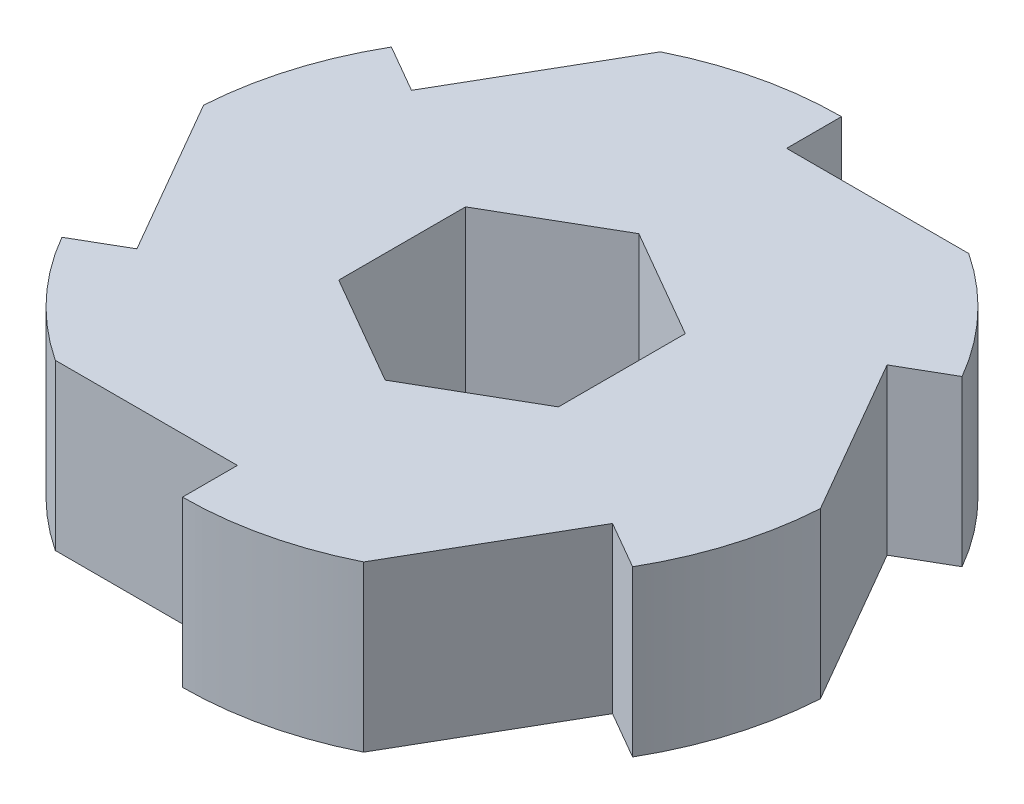
ISO-10303-21;
HEADER;
FILE_DESCRIPTION(('STEP AP214'),'2;1');
FILE_NAME('part.step','',(''),(''),'','','');
FILE_SCHEMA(('AUTOMOTIVE_DESIGN { 1 0 10303 214 1 1 1 1 }'));
ENDSEC;
DATA;
#1=APPLICATION_CONTEXT('core data for automotive mechanical design processes');
#2=APPLICATION_PROTOCOL_DEFINITION('international standard','automotive_design',2000,#1);
#3=PRODUCT_CONTEXT('',#1,'mechanical');
#4=PRODUCT('Part','Part','',(#3));
#5=PRODUCT_RELATED_PRODUCT_CATEGORY('part','',(#4));
#6=PRODUCT_DEFINITION_FORMATION('','',#4);
#7=PRODUCT_DEFINITION_CONTEXT('part definition',#1,'design');
#8=PRODUCT_DEFINITION('design','',#6,#7);
#9=PRODUCT_DEFINITION_SHAPE('','',#8);
#10=(LENGTH_UNIT() NAMED_UNIT(*) SI_UNIT(.MILLI.,.METRE.));
#11=(NAMED_UNIT(*) PLANE_ANGLE_UNIT() SI_UNIT($,.RADIAN.));
#12=(NAMED_UNIT(*) SI_UNIT($,.STERADIAN.) SOLID_ANGLE_UNIT());
#13=UNCERTAINTY_MEASURE_WITH_UNIT(LENGTH_MEASURE(1.E-05),#10,'distance_accuracy_value','');
#14=(GEOMETRIC_REPRESENTATION_CONTEXT(3) GLOBAL_UNCERTAINTY_ASSIGNED_CONTEXT((#13)) GLOBAL_UNIT_ASSIGNED_CONTEXT((#10,
#11,#12)) REPRESENTATION_CONTEXT('',''));
#15=CARTESIAN_POINT('',(0.,0.,0.));
#16=DIRECTION('',(0.,0.,1.));
#17=DIRECTION('',(1.,0.,0.));
#18=AXIS2_PLACEMENT_3D('',#15,#16,#17);
#19=CARTESIAN_POINT('',(0.,9.525,0.));
#20=DIRECTION('',(0.,-1.,0.));
#21=DIRECTION('',(0.,0.,-1.));
#22=AXIS2_PLACEMENT_3D('',#19,#20,#21);
#23=CYLINDRICAL_SURFACE('',#22,19.05);
#24=DIRECTION('',(0.,-1.,0.));
#25=VECTOR('',#24,1.);
#26=CARTESIAN_POINT('',(19.0132951397672,77.9211990103434,1.1819932013789));
#27=LINE('',#26,#25);
#28=CARTESIAN_POINT('',(19.0132951397672,9.525,1.1819932013789));
#29=VERTEX_POINT('',#28);
#30=CARTESIAN_POINT('',(19.0132951397672,0.,1.1819932013789));
#31=VERTEX_POINT('',#30);
#32=EDGE_CURVE('E255',#29,#31,#27,.T.);
#33=ORIENTED_EDGE('',*,*,#32,.F.);
#34=CARTESIAN_POINT('',(0.,9.525,0.));
#35=DIRECTION('',(0.,1.,0.));
#36=DIRECTION('',(0.,0.,1.));
#37=AXIS2_PLACEMENT_3D('',#34,#35,#36);
#38=CIRCLE('',#37,19.05);
#39=CARTESIAN_POINT('',(16.4977839420936,9.525,9.52499999999985));
#40=VERTEX_POINT('',#39);
#41=EDGE_CURVE('E384',#40,#29,#38,.T.);
#42=ORIENTED_EDGE('',*,*,#41,.F.);
#43=DIRECTION('',(0.,-1.,0.));
#44=VECTOR('',#43,1.);
#45=CARTESIAN_POINT('',(16.4977839420936,77.9211990103434,9.52499999999985));
#46=LINE('',#45,#44);
#47=CARTESIAN_POINT('',(16.4977839420936,0.,9.52499999999985));
#48=VERTEX_POINT('',#47);
#49=EDGE_CURVE('E270',#40,#48,#46,.T.);
#50=ORIENTED_EDGE('',*,*,#49,.T.);
#51=CARTESIAN_POINT('',(0.,0.,0.));
#52=DIRECTION('',(0.,1.,0.));
#53=DIRECTION('',(0.,0.,1.));
#54=AXIS2_PLACEMENT_3D('',#51,#52,#53);
#55=CIRCLE('',#54,19.05);
#56=EDGE_CURVE('E424',#48,#31,#55,.T.);
#57=ORIENTED_EDGE('',*,*,#56,.T.);
#58=EDGE_LOOP('',(#33,#42,#50,#57));
#59=FACE_BOUND('',#58,.T.);
#60=ADVANCED_FACE('F41',(#59),#23,.T.);
#61=CARTESIAN_POINT('',(0.,9.525,0.));
#62=DIRECTION('',(0.,1.,0.));
#63=DIRECTION('',(0.,0.,1.));
#64=AXIS2_PLACEMENT_3D('',#61,#62,#63);
#65=PLANE('',#64);
#66=DIRECTION('',(-0.866025403784438,0.,-0.5));
#67=VECTOR('',#66,1.);
#68=CARTESIAN_POINT('',(6.35,9.525,-3.66617420935412));
#69=LINE('',#68,#67);
#70=CARTESIAN_POINT('',(6.35,9.525,-3.66617420935412));
#71=VERTEX_POINT('',#70);
#72=CARTESIAN_POINT('',(0.,9.525,-7.33234841870825));
#73=VERTEX_POINT('',#72);
#74=EDGE_CURVE('E56',#71,#73,#69,.T.);
#75=ORIENTED_EDGE('',*,*,#74,.F.);
#76=DIRECTION('',(0.,0.,-1.));
#77=VECTOR('',#76,1.);
#78=CARTESIAN_POINT('',(6.35,9.525,3.66617420935412));
#79=LINE('',#78,#77);
#80=CARTESIAN_POINT('',(6.35,9.525,3.66617420935412));
#81=VERTEX_POINT('',#80);
#82=EDGE_CURVE('E221',#81,#71,#79,.T.);
#83=ORIENTED_EDGE('',*,*,#82,.F.);
#84=DIRECTION('',(0.866025403784439,0.,-0.5));
#85=VECTOR('',#84,1.);
#86=CARTESIAN_POINT('',(0.,9.525,7.33234841870825));
#87=LINE('',#86,#85);
#88=CARTESIAN_POINT('',(0.,9.525,7.33234841870825));
#89=VERTEX_POINT('',#88);
#90=EDGE_CURVE('E224',#89,#81,#87,.T.);
#91=ORIENTED_EDGE('',*,*,#90,.F.);
#92=DIRECTION('',(0.866025403784438,0.,0.5));
#93=VECTOR('',#92,1.);
#94=CARTESIAN_POINT('',(-6.35,9.525,3.66617420935412));
#95=LINE('',#94,#93);
#96=CARTESIAN_POINT('',(-6.35,9.525,3.66617420935412));
#97=VERTEX_POINT('',#96);
#98=EDGE_CURVE('E240',#97,#89,#95,.T.);
#99=ORIENTED_EDGE('',*,*,#98,.F.);
#100=DIRECTION('',(0.,0.,1.));
#101=VECTOR('',#100,1.);
#102=CARTESIAN_POINT('',(-6.35,9.525,-3.66617420935412));
#103=LINE('',#102,#101);
#104=CARTESIAN_POINT('',(-6.35,9.525,-3.66617420935412));
#105=VERTEX_POINT('',#104);
#106=EDGE_CURVE('E237',#105,#97,#103,.T.);
#107=ORIENTED_EDGE('',*,*,#106,.F.);
#108=DIRECTION('',(-0.866025403784439,0.,0.5));
#109=VECTOR('',#108,1.);
#110=CARTESIAN_POINT('',(0.,9.525,-7.33234841870825));
#111=LINE('',#110,#109);
#112=EDGE_CURVE('E235',#73,#105,#111,.T.);
#113=ORIENTED_EDGE('',*,*,#112,.F.);
#114=EDGE_LOOP('',(#75,#83,#91,#99,#107,#113));
#115=FACE_BOUND('',#114,.T.);
#116=DIRECTION('',(-0.50000000000001,0.,-0.866025403784433));
#117=VECTOR('',#116,1.);
#118=CARTESIAN_POINT('',(13.7481532850779,9.525,-7.93750000000016));
#119=LINE('',#118,#117);
#120=CARTESIAN_POINT('',(13.7481532850779,9.525,-7.93750000000016));
#121=VERTEX_POINT('',#120);
#122=EDGE_CURVE('E262',#29,#121,#119,.T.);
#123=ORIENTED_EDGE('',*,*,#122,.T.);
#124=DIRECTION('',(0.866025403784433,0.,-0.50000000000001));
#125=VECTOR('',#124,1.);
#126=CARTESIAN_POINT('',(0.,9.525,0.));
#127=LINE('',#126,#125);
#128=CARTESIAN_POINT('',(16.4977839420934,9.525,-9.52500000000019));
#129=VERTEX_POINT('',#128);
#130=EDGE_CURVE('E264',#121,#129,#127,.T.);
#131=ORIENTED_EDGE('',*,*,#130,.T.);
#132=CARTESIAN_POINT('',(10.5302837093784,9.525,-15.875));
#133=VERTEX_POINT('',#132);
#134=EDGE_CURVE('E332',#129,#133,#38,.T.);
#135=ORIENTED_EDGE('',*,*,#134,.T.);
#136=DIRECTION('',(-1.,0.,0.));
#137=VECTOR('',#136,1.);
#138=CARTESIAN_POINT('',(0.,9.525,-15.875));
#139=LINE('',#138,#137);
#140=CARTESIAN_POINT('',(0.,9.525,-15.875));
#141=VERTEX_POINT('',#140);
#142=EDGE_CURVE('E322',#133,#141,#139,.T.);
#143=ORIENTED_EDGE('',*,*,#142,.T.);
#144=DIRECTION('',(0.,0.,-1.));
#145=VECTOR('',#144,1.);
#146=CARTESIAN_POINT('',(0.,9.525,0.));
#147=LINE('',#146,#145);
#148=CARTESIAN_POINT('',(0.,9.525,-19.05));
#149=VERTEX_POINT('',#148);
#150=EDGE_CURVE('E324',#141,#149,#147,.T.);
#151=ORIENTED_EDGE('',*,*,#150,.T.);
#152=CARTESIAN_POINT('',(-8.48301143038881,9.525,-17.0569932013791));
#153=VERTEX_POINT('',#152);
#154=EDGE_CURVE('E327',#149,#153,#38,.T.);
#155=ORIENTED_EDGE('',*,*,#154,.T.);
#156=DIRECTION('',(-0.499999999999998,0.,0.86602540378444));
#157=VECTOR('',#156,1.);
#158=CARTESIAN_POINT('',(-13.748153285078,9.525,-7.93749999999997));
#159=LINE('',#158,#157);
#160=CARTESIAN_POINT('',(-13.748153285078,9.525,-7.93749999999997));
#161=VERTEX_POINT('',#160);
#162=EDGE_CURVE('E310',#153,#161,#159,.T.);
#163=ORIENTED_EDGE('',*,*,#162,.T.);
#164=DIRECTION('',(-0.86602540378444,0.,-0.499999999999998));
#165=VECTOR('',#164,1.);
#166=CARTESIAN_POINT('',(0.,9.525,0.));
#167=LINE('',#166,#165);
#168=CARTESIAN_POINT('',(-16.4977839420936,9.525,-9.52499999999996));
#169=VERTEX_POINT('',#168);
#170=EDGE_CURVE('E312',#161,#169,#167,.T.);
#171=ORIENTED_EDGE('',*,*,#170,.T.);
#172=CARTESIAN_POINT('',(-19.0132951397672,9.525,-1.18199320137902));
#173=VERTEX_POINT('',#172);
#174=EDGE_CURVE('E331',#169,#173,#38,.T.);
#175=ORIENTED_EDGE('',*,*,#174,.T.);
#176=DIRECTION('',(0.500000000000004,0.,0.866025403784436));
#177=VECTOR('',#176,1.);
#178=CARTESIAN_POINT('',(-13.7481532850779,9.525,7.93750000000007));
#179=LINE('',#178,#177);
#180=CARTESIAN_POINT('',(-13.7481532850779,9.525,7.93750000000007));
#181=VERTEX_POINT('',#180);
#182=EDGE_CURVE('E298',#173,#181,#179,.T.);
#183=ORIENTED_EDGE('',*,*,#182,.T.);
#184=DIRECTION('',(-0.866025403784436,0.,0.500000000000004));
#185=VECTOR('',#184,1.);
#186=CARTESIAN_POINT('',(0.,9.525,0.));
#187=LINE('',#186,#185);
#188=CARTESIAN_POINT('',(-16.4977839420935,9.525,9.52500000000008));
#189=VERTEX_POINT('',#188);
#190=EDGE_CURVE('E300',#181,#189,#187,.T.);
#191=ORIENTED_EDGE('',*,*,#190,.T.);
#192=CARTESIAN_POINT('',(-10.5302837093784,9.525,15.875));
#193=VERTEX_POINT('',#192);
#194=EDGE_CURVE('E388',#189,#193,#38,.T.);
#195=ORIENTED_EDGE('',*,*,#194,.T.);
#196=DIRECTION('',(1.,0.,0.));
#197=VECTOR('',#196,1.);
#198=CARTESIAN_POINT('',(0.,9.525,15.875));
#199=LINE('',#198,#197);
#200=CARTESIAN_POINT('',(0.,9.525,15.875));
#201=VERTEX_POINT('',#200);
#202=EDGE_CURVE('E286',#193,#201,#199,.T.);
#203=ORIENTED_EDGE('',*,*,#202,.T.);
#204=DIRECTION('',(0.,0.,1.));
#205=VECTOR('',#204,1.);
#206=CARTESIAN_POINT('',(0.,9.525,0.));
#207=LINE('',#206,#205);
#208=CARTESIAN_POINT('',(0.,9.525,19.05));
#209=VERTEX_POINT('',#208);
#210=EDGE_CURVE('E288',#201,#209,#207,.T.);
#211=ORIENTED_EDGE('',*,*,#210,.T.);
#212=CARTESIAN_POINT('',(8.48301143038892,9.525,17.056993201379));
#213=VERTEX_POINT('',#212);
#214=EDGE_CURVE('E385',#209,#213,#38,.T.);
#215=ORIENTED_EDGE('',*,*,#214,.T.);
#216=DIRECTION('',(0.499999999999992,0.,-0.866025403784443));
#217=VECTOR('',#216,1.);
#218=CARTESIAN_POINT('',(13.748153285078,9.525,7.93749999999987));
#219=LINE('',#218,#217);
#220=CARTESIAN_POINT('',(13.748153285078,9.525,7.93749999999987));
#221=VERTEX_POINT('',#220);
#222=EDGE_CURVE('E274',#213,#221,#219,.T.);
#223=ORIENTED_EDGE('',*,*,#222,.T.);
#224=DIRECTION('',(0.866025403784443,0.,0.499999999999992));
#225=VECTOR('',#224,1.);
#226=CARTESIAN_POINT('',(0.,9.525,0.));
#227=LINE('',#226,#225);
#228=EDGE_CURVE('E276',#221,#40,#227,.T.);
#229=ORIENTED_EDGE('',*,*,#228,.T.);
#230=ORIENTED_EDGE('',*,*,#41,.T.);
#231=EDGE_LOOP('',(#123,#131,#135,#143,#151,#155,#163,#171,#175,#183,#191,#195,#203,#211,#215,
#223,#229,#230));
#232=FACE_BOUND('',#231,.T.);
#233=ADVANCED_FACE('F378',(#115,#232),#65,.T.);
#234=CARTESIAN_POINT('',(0.,0.,0.));
#235=DIRECTION('',(0.,1.,0.));
#236=DIRECTION('',(0.,0.,1.));
#237=AXIS2_PLACEMENT_3D('',#234,#235,#236);
#238=PLANE('',#237);
#239=DIRECTION('',(0.,0.,-1.));
#240=VECTOR('',#239,1.);
#241=CARTESIAN_POINT('',(6.35,0.,3.66617420935412));
#242=LINE('',#241,#240);
#243=CARTESIAN_POINT('',(6.35,0.,3.66617420935412));
#244=VERTEX_POINT('',#243);
#245=CARTESIAN_POINT('',(6.35,0.,-3.66617420935412));
#246=VERTEX_POINT('',#245);
#247=EDGE_CURVE('E210',#244,#246,#242,.T.);
#248=ORIENTED_EDGE('',*,*,#247,.T.);
#249=DIRECTION('',(-0.866025403784438,0.,-0.5));
#250=VECTOR('',#249,1.);
#251=CARTESIAN_POINT('',(6.35,0.,-3.66617420935412));
#252=LINE('',#251,#250);
#253=CARTESIAN_POINT('',(0.,0.,-7.33234841870825));
#254=VERTEX_POINT('',#253);
#255=EDGE_CURVE('E204',#246,#254,#252,.T.);
#256=ORIENTED_EDGE('',*,*,#255,.T.);
#257=DIRECTION('',(-0.866025403784439,0.,0.5));
#258=VECTOR('',#257,1.);
#259=CARTESIAN_POINT('',(0.,0.,-7.33234841870825));
#260=LINE('',#259,#258);
#261=CARTESIAN_POINT('',(-6.35,0.,-3.66617420935412));
#262=VERTEX_POINT('',#261);
#263=EDGE_CURVE('E213',#254,#262,#260,.T.);
#264=ORIENTED_EDGE('',*,*,#263,.T.);
#265=DIRECTION('',(0.,0.,1.));
#266=VECTOR('',#265,1.);
#267=CARTESIAN_POINT('',(-6.35,0.,-3.66617420935412));
#268=LINE('',#267,#266);
#269=CARTESIAN_POINT('',(-6.35,0.,3.66617420935412));
#270=VERTEX_POINT('',#269);
#271=EDGE_CURVE('E64',#262,#270,#268,.T.);
#272=ORIENTED_EDGE('',*,*,#271,.T.);
#273=DIRECTION('',(0.866025403784438,0.,0.5));
#274=VECTOR('',#273,1.);
#275=CARTESIAN_POINT('',(-6.35,0.,3.66617420935412));
#276=LINE('',#275,#274);
#277=CARTESIAN_POINT('',(0.,0.,7.33234841870825));
#278=VERTEX_POINT('',#277);
#279=EDGE_CURVE('E228',#270,#278,#276,.T.);
#280=ORIENTED_EDGE('',*,*,#279,.T.);
#281=DIRECTION('',(0.866025403784439,0.,-0.5));
#282=VECTOR('',#281,1.);
#283=CARTESIAN_POINT('',(0.,0.,7.33234841870825));
#284=LINE('',#283,#282);
#285=EDGE_CURVE('E231',#278,#244,#284,.T.);
#286=ORIENTED_EDGE('',*,*,#285,.T.);
#287=EDGE_LOOP('',(#248,#256,#264,#272,#280,#286));
#288=FACE_BOUND('',#287,.T.);
#289=DIRECTION('',(0.866025403784433,0.,-0.50000000000001));
#290=VECTOR('',#289,1.);
#291=CARTESIAN_POINT('',(0.,0.,0.));
#292=LINE('',#291,#290);
#293=CARTESIAN_POINT('',(13.7481532850779,0.,-7.93750000000016));
#294=VERTEX_POINT('',#293);
#295=CARTESIAN_POINT('',(16.4977839420934,0.,-9.52500000000019));
#296=VERTEX_POINT('',#295);
#297=EDGE_CURVE('E11',#294,#296,#292,.T.);
#298=ORIENTED_EDGE('',*,*,#297,.F.);
#299=DIRECTION('',(-0.50000000000001,0.,-0.866025403784433));
#300=VECTOR('',#299,1.);
#301=CARTESIAN_POINT('',(13.7481532850779,0.,-7.93750000000016));
#302=LINE('',#301,#300);
#303=EDGE_CURVE('E49',#31,#294,#302,.T.);
#304=ORIENTED_EDGE('',*,*,#303,.F.);
#305=ORIENTED_EDGE('',*,*,#56,.F.);
#306=DIRECTION('',(0.866025403784443,0.,0.499999999999992));
#307=VECTOR('',#306,1.);
#308=CARTESIAN_POINT('',(0.,0.,0.));
#309=LINE('',#308,#307);
#310=CARTESIAN_POINT('',(13.748153285078,0.,7.93749999999987));
#311=VERTEX_POINT('',#310);
#312=EDGE_CURVE('E363',#311,#48,#309,.T.);
#313=ORIENTED_EDGE('',*,*,#312,.F.);
#314=DIRECTION('',(0.499999999999992,0.,-0.866025403784443));
#315=VECTOR('',#314,1.);
#316=CARTESIAN_POINT('',(13.748153285078,0.,7.93749999999987));
#317=LINE('',#316,#315);
#318=CARTESIAN_POINT('',(8.48301143038892,0.,17.056993201379));
#319=VERTEX_POINT('',#318);
#320=EDGE_CURVE('E360',#319,#311,#317,.T.);
#321=ORIENTED_EDGE('',*,*,#320,.F.);
#322=CARTESIAN_POINT('',(0.,0.,19.05));
#323=VERTEX_POINT('',#322);
#324=EDGE_CURVE('E423',#323,#319,#55,.T.);
#325=ORIENTED_EDGE('',*,*,#324,.F.);
#326=DIRECTION('',(0.,0.,1.));
#327=VECTOR('',#326,1.);
#328=CARTESIAN_POINT('',(0.,0.,0.));
#329=LINE('',#328,#327);
#330=CARTESIAN_POINT('',(0.,0.,15.875));
#331=VERTEX_POINT('',#330);
#332=EDGE_CURVE('E357',#331,#323,#329,.T.);
#333=ORIENTED_EDGE('',*,*,#332,.F.);
#334=DIRECTION('',(1.,0.,0.));
#335=VECTOR('',#334,1.);
#336=CARTESIAN_POINT('',(0.,0.,15.875));
#337=LINE('',#336,#335);
#338=CARTESIAN_POINT('',(-10.5302837093784,0.,15.875));
#339=VERTEX_POINT('',#338);
#340=EDGE_CURVE('E354',#339,#331,#337,.T.);
#341=ORIENTED_EDGE('',*,*,#340,.F.);
#342=CARTESIAN_POINT('',(-16.4977839420935,0.,9.52500000000008));
#343=VERTEX_POINT('',#342);
#344=EDGE_CURVE('E411',#343,#339,#55,.T.);
#345=ORIENTED_EDGE('',*,*,#344,.F.);
#346=DIRECTION('',(-0.866025403784436,0.,0.500000000000004));
#347=VECTOR('',#346,1.);
#348=CARTESIAN_POINT('',(0.,0.,0.));
#349=LINE('',#348,#347);
#350=CARTESIAN_POINT('',(-13.7481532850779,0.,7.93750000000007));
#351=VERTEX_POINT('',#350);
#352=EDGE_CURVE('E351',#351,#343,#349,.T.);
#353=ORIENTED_EDGE('',*,*,#352,.F.);
#354=DIRECTION('',(0.500000000000004,0.,0.866025403784436));
#355=VECTOR('',#354,1.);
#356=CARTESIAN_POINT('',(-13.7481532850779,0.,7.93750000000007));
#357=LINE('',#356,#355);
#358=CARTESIAN_POINT('',(-19.0132951397672,0.,-1.18199320137902));
#359=VERTEX_POINT('',#358);
#360=EDGE_CURVE('E348',#359,#351,#357,.T.);
#361=ORIENTED_EDGE('',*,*,#360,.F.);
#362=CARTESIAN_POINT('',(-16.4977839420936,0.,-9.52499999999996));
#363=VERTEX_POINT('',#362);
#364=EDGE_CURVE('E336',#363,#359,#55,.T.);
#365=ORIENTED_EDGE('',*,*,#364,.F.);
#366=DIRECTION('',(-0.86602540378444,0.,-0.499999999999998));
#367=VECTOR('',#366,1.);
#368=CARTESIAN_POINT('',(0.,0.,0.));
#369=LINE('',#368,#367);
#370=CARTESIAN_POINT('',(-13.748153285078,0.,-7.93749999999997));
#371=VERTEX_POINT('',#370);
#372=EDGE_CURVE('E345',#371,#363,#369,.T.);
#373=ORIENTED_EDGE('',*,*,#372,.F.);
#374=DIRECTION('',(-0.499999999999998,0.,0.86602540378444));
#375=VECTOR('',#374,1.);
#376=CARTESIAN_POINT('',(-13.748153285078,0.,-7.93749999999997));
#377=LINE('',#376,#375);
#378=CARTESIAN_POINT('',(-8.48301143038881,0.,-17.0569932013791));
#379=VERTEX_POINT('',#378);
#380=EDGE_CURVE('E342',#379,#371,#377,.T.);
#381=ORIENTED_EDGE('',*,*,#380,.F.);
#382=CARTESIAN_POINT('',(0.,0.,-19.05));
#383=VERTEX_POINT('',#382);
#384=EDGE_CURVE('E333',#383,#379,#55,.T.);
#385=ORIENTED_EDGE('',*,*,#384,.F.);
#386=DIRECTION('',(0.,0.,-1.));
#387=VECTOR('',#386,1.);
#388=CARTESIAN_POINT('',(0.,0.,0.));
#389=LINE('',#388,#387);
#390=CARTESIAN_POINT('',(0.,0.,-15.875));
#391=VERTEX_POINT('',#390);
#392=EDGE_CURVE('E339',#391,#383,#389,.T.);
#393=ORIENTED_EDGE('',*,*,#392,.F.);
#394=DIRECTION('',(-1.,0.,0.));
#395=VECTOR('',#394,1.);
#396=CARTESIAN_POINT('',(0.,0.,-15.875));
#397=LINE('',#396,#395);
#398=CARTESIAN_POINT('',(10.5302837093784,0.,-15.875));
#399=VERTEX_POINT('',#398);
#400=EDGE_CURVE('E330',#399,#391,#397,.T.);
#401=ORIENTED_EDGE('',*,*,#400,.F.);
#402=EDGE_CURVE('E326',#296,#399,#55,.T.);
#403=ORIENTED_EDGE('',*,*,#402,.F.);
#404=EDGE_LOOP('',(#298,#304,#305,#313,#321,#325,#333,#341,#345,#353,#361,#365,#373,#381,#385,
#393,#401,#403));
#405=FACE_BOUND('',#404,.T.);
#406=ADVANCED_FACE('F217',(#288,#405),#238,.F.);
#407=DIRECTION('',(0.,-1.,0.));
#408=VECTOR('',#407,1.);
#409=CARTESIAN_POINT('',(8.48301143038892,77.9211990103434,17.056993201379));
#410=LINE('',#409,#408);
#411=EDGE_CURVE('E267',#213,#319,#410,.T.);
#412=ORIENTED_EDGE('',*,*,#411,.F.);
#413=ORIENTED_EDGE('',*,*,#214,.F.);
#414=DIRECTION('',(0.,-1.,0.));
#415=VECTOR('',#414,1.);
#416=CARTESIAN_POINT('',(0.,77.9211990103434,19.05));
#417=LINE('',#416,#415);
#418=EDGE_CURVE('E282',#209,#323,#417,.T.);
#419=ORIENTED_EDGE('',*,*,#418,.T.);
#420=ORIENTED_EDGE('',*,*,#324,.T.);
#421=EDGE_LOOP('',(#412,#413,#419,#420));
#422=FACE_BOUND('',#421,.T.);
#423=ADVANCED_FACE('F422',(#422),#23,.T.);
#424=DIRECTION('',(0.,-1.,0.));
#425=VECTOR('',#424,1.);
#426=CARTESIAN_POINT('',(-10.5302837093784,77.9211990103434,15.875));
#427=LINE('',#426,#425);
#428=EDGE_CURVE('E279',#193,#339,#427,.T.);
#429=ORIENTED_EDGE('',*,*,#428,.F.);
#430=ORIENTED_EDGE('',*,*,#194,.F.);
#431=DIRECTION('',(0.,-1.,0.));
#432=VECTOR('',#431,1.);
#433=CARTESIAN_POINT('',(-16.4977839420935,77.9211990103434,9.52500000000008));
#434=LINE('',#433,#432);
#435=EDGE_CURVE('E294',#189,#343,#434,.T.);
#436=ORIENTED_EDGE('',*,*,#435,.T.);
#437=ORIENTED_EDGE('',*,*,#344,.T.);
#438=EDGE_LOOP('',(#429,#430,#436,#437));
#439=FACE_BOUND('',#438,.T.);
#440=ADVANCED_FACE('F408',(#439),#23,.T.);
#441=DIRECTION('',(0.,-1.,0.));
#442=VECTOR('',#441,1.);
#443=CARTESIAN_POINT('',(-19.0132951397672,77.9211990103434,-1.18199320137903));
#444=LINE('',#443,#442);
#445=EDGE_CURVE('E291',#173,#359,#444,.T.);
#446=ORIENTED_EDGE('',*,*,#445,.F.);
#447=ORIENTED_EDGE('',*,*,#174,.F.);
#448=DIRECTION('',(0.,-1.,0.));
#449=VECTOR('',#448,1.);
#450=CARTESIAN_POINT('',(-16.4977839420936,77.9211990103434,-9.52499999999996));
#451=LINE('',#450,#449);
#452=EDGE_CURVE('E306',#169,#363,#451,.T.);
#453=ORIENTED_EDGE('',*,*,#452,.T.);
#454=ORIENTED_EDGE('',*,*,#364,.T.);
#455=EDGE_LOOP('',(#446,#447,#453,#454));
#456=FACE_BOUND('',#455,.T.);
#457=ADVANCED_FACE('F446',(#456),#23,.T.);
#458=DIRECTION('',(0.,-1.,0.));
#459=VECTOR('',#458,1.);
#460=CARTESIAN_POINT('',(-8.48301143038881,77.9211990103434,-17.0569932013791));
#461=LINE('',#460,#459);
#462=EDGE_CURVE('E303',#153,#379,#461,.T.);
#463=ORIENTED_EDGE('',*,*,#462,.F.);
#464=ORIENTED_EDGE('',*,*,#154,.F.);
#465=DIRECTION('',(0.,-1.,0.));
#466=VECTOR('',#465,1.);
#467=CARTESIAN_POINT('',(0.,77.9211990103434,-19.05));
#468=LINE('',#467,#466);
#469=EDGE_CURVE('E318',#149,#383,#468,.T.);
#470=ORIENTED_EDGE('',*,*,#469,.T.);
#471=ORIENTED_EDGE('',*,*,#384,.T.);
#472=EDGE_LOOP('',(#463,#464,#470,#471));
#473=FACE_BOUND('',#472,.T.);
#474=ADVANCED_FACE('F437',(#473),#23,.T.);
#475=ORIENTED_EDGE('',*,*,#134,.F.);
#476=DIRECTION('',(0.,-1.,0.));
#477=VECTOR('',#476,1.);
#478=CARTESIAN_POINT('',(16.4977839420934,77.9211990103434,-9.52500000000019));
#479=LINE('',#478,#477);
#480=EDGE_CURVE('E258',#129,#296,#479,.T.);
#481=ORIENTED_EDGE('',*,*,#480,.T.);
#482=ORIENTED_EDGE('',*,*,#402,.T.);
#483=DIRECTION('',(0.,-1.,0.));
#484=VECTOR('',#483,1.);
#485=CARTESIAN_POINT('',(10.5302837093784,77.9211990103434,-15.875));
#486=LINE('',#485,#484);
#487=EDGE_CURVE('E315',#133,#399,#486,.T.);
#488=ORIENTED_EDGE('',*,*,#487,.F.);
#489=EDGE_LOOP('',(#475,#481,#482,#488));
#490=FACE_BOUND('',#489,.T.);
#491=ADVANCED_FACE('F43',(#490),#23,.T.);
#492=CARTESIAN_POINT('',(0.,77.9211990103434,-19.05));
#493=DIRECTION('',(1.,0.,0.));
#494=DIRECTION('',(0.,0.,-1.));
#495=AXIS2_PLACEMENT_3D('',#492,#493,#494);
#496=PLANE('',#495);
#497=ORIENTED_EDGE('',*,*,#150,.F.);
#498=DIRECTION('',(0.,-1.,0.));
#499=VECTOR('',#498,1.);
#500=CARTESIAN_POINT('',(0.,77.9211990103434,-15.875));
#501=LINE('',#500,#499);
#502=EDGE_CURVE('E314',#141,#391,#501,.T.);
#503=ORIENTED_EDGE('',*,*,#502,.T.);
#504=ORIENTED_EDGE('',*,*,#392,.T.);
#505=ORIENTED_EDGE('',*,*,#469,.F.);
#506=EDGE_LOOP('',(#497,#503,#504,#505));
#507=FACE_BOUND('',#506,.T.);
#508=ADVANCED_FACE('F435',(#507),#496,.T.);
#509=CARTESIAN_POINT('',(0.,77.9211990103434,-15.875));
#510=DIRECTION('',(0.,0.,-1.));
#511=DIRECTION('',(-1.,0.,0.));
#512=AXIS2_PLACEMENT_3D('',#509,#510,#511);
#513=PLANE('',#512);
#514=ORIENTED_EDGE('',*,*,#142,.F.);
#515=ORIENTED_EDGE('',*,*,#487,.T.);
#516=ORIENTED_EDGE('',*,*,#400,.T.);
#517=ORIENTED_EDGE('',*,*,#502,.F.);
#518=EDGE_LOOP('',(#514,#515,#516,#517));
#519=FACE_BOUND('',#518,.T.);
#520=ADVANCED_FACE('F430',(#519),#513,.T.);
#521=CARTESIAN_POINT('',(-16.4977839420936,77.9211990103434,-9.52499999999996));
#522=DIRECTION('',(0.499999999999998,0.,-0.86602540378444));
#523=DIRECTION('',(-0.86602540378444,0.,-0.499999999999998));
#524=AXIS2_PLACEMENT_3D('',#521,#522,#523);
#525=PLANE('',#524);
#526=ORIENTED_EDGE('',*,*,#170,.F.);
#527=DIRECTION('',(0.,-1.,0.));
#528=VECTOR('',#527,1.);
#529=CARTESIAN_POINT('',(-13.748153285078,77.9211990103434,-7.93749999999997));
#530=LINE('',#529,#528);
#531=EDGE_CURVE('E302',#161,#371,#530,.T.);
#532=ORIENTED_EDGE('',*,*,#531,.T.);
#533=ORIENTED_EDGE('',*,*,#372,.T.);
#534=ORIENTED_EDGE('',*,*,#452,.F.);
#535=EDGE_LOOP('',(#526,#532,#533,#534));
#536=FACE_BOUND('',#535,.T.);
#537=ADVANCED_FACE('F444',(#536),#525,.T.);
#538=CARTESIAN_POINT('',(-13.748153285078,77.9211990103434,-7.93749999999997));
#539=DIRECTION('',(-0.86602540378444,0.,-0.499999999999998));
#540=DIRECTION('',(-0.499999999999998,0.,0.86602540378444));
#541=AXIS2_PLACEMENT_3D('',#538,#539,#540);
#542=PLANE('',#541);
#543=ORIENTED_EDGE('',*,*,#162,.F.);
#544=ORIENTED_EDGE('',*,*,#462,.T.);
#545=ORIENTED_EDGE('',*,*,#380,.T.);
#546=ORIENTED_EDGE('',*,*,#531,.F.);
#547=EDGE_LOOP('',(#543,#544,#545,#546));
#548=FACE_BOUND('',#547,.T.);
#549=ADVANCED_FACE('F442',(#548),#542,.T.);
#550=CARTESIAN_POINT('',(-16.4977839420935,77.9211990103434,9.52500000000008));
#551=DIRECTION('',(-0.500000000000004,0.,-0.866025403784436));
#552=DIRECTION('',(-0.866025403784436,0.,0.500000000000004));
#553=AXIS2_PLACEMENT_3D('',#550,#551,#552);
#554=PLANE('',#553);
#555=ORIENTED_EDGE('',*,*,#190,.F.);
#556=DIRECTION('',(0.,-1.,0.));
#557=VECTOR('',#556,1.);
#558=CARTESIAN_POINT('',(-13.7481532850779,77.9211990103434,7.93750000000007));
#559=LINE('',#558,#557);
#560=EDGE_CURVE('E290',#181,#351,#559,.T.);
#561=ORIENTED_EDGE('',*,*,#560,.T.);
#562=ORIENTED_EDGE('',*,*,#352,.T.);
#563=ORIENTED_EDGE('',*,*,#435,.F.);
#564=EDGE_LOOP('',(#555,#561,#562,#563));
#565=FACE_BOUND('',#564,.T.);
#566=ADVANCED_FACE('F405',(#565),#554,.T.);
#567=CARTESIAN_POINT('',(-13.7481532850779,77.9211990103434,7.93750000000007));
#568=DIRECTION('',(-0.866025403784436,0.,0.500000000000004));
#569=DIRECTION('',(0.500000000000004,0.,0.866025403784436));
#570=AXIS2_PLACEMENT_3D('',#567,#568,#569);
#571=PLANE('',#570);
#572=ORIENTED_EDGE('',*,*,#182,.F.);
#573=ORIENTED_EDGE('',*,*,#445,.T.);
#574=ORIENTED_EDGE('',*,*,#360,.T.);
#575=ORIENTED_EDGE('',*,*,#560,.F.);
#576=EDGE_LOOP('',(#572,#573,#574,#575));
#577=FACE_BOUND('',#576,.T.);
#578=ADVANCED_FACE('F403',(#577),#571,.T.);
#579=CARTESIAN_POINT('',(0.,77.9211990103434,19.05));
#580=DIRECTION('',(-1.,0.,0.));
#581=DIRECTION('',(0.,0.,1.));
#582=AXIS2_PLACEMENT_3D('',#579,#580,#581);
#583=PLANE('',#582);
#584=ORIENTED_EDGE('',*,*,#210,.F.);
#585=DIRECTION('',(0.,-1.,0.));
#586=VECTOR('',#585,1.);
#587=CARTESIAN_POINT('',(0.,77.9211990103434,15.875));
#588=LINE('',#587,#586);
#589=EDGE_CURVE('E278',#201,#331,#588,.T.);
#590=ORIENTED_EDGE('',*,*,#589,.T.);
#591=ORIENTED_EDGE('',*,*,#332,.T.);
#592=ORIENTED_EDGE('',*,*,#418,.F.);
#593=EDGE_LOOP('',(#584,#590,#591,#592));
#594=FACE_BOUND('',#593,.T.);
#595=ADVANCED_FACE('F418',(#594),#583,.T.);
#596=CARTESIAN_POINT('',(0.,77.9211990103434,15.875));
#597=DIRECTION('',(0.,0.,1.));
#598=DIRECTION('',(1.,0.,0.));
#599=AXIS2_PLACEMENT_3D('',#596,#597,#598);
#600=PLANE('',#599);
#601=ORIENTED_EDGE('',*,*,#202,.F.);
#602=ORIENTED_EDGE('',*,*,#428,.T.);
#603=ORIENTED_EDGE('',*,*,#340,.T.);
#604=ORIENTED_EDGE('',*,*,#589,.F.);
#605=EDGE_LOOP('',(#601,#602,#603,#604));
#606=FACE_BOUND('',#605,.T.);
#607=ADVANCED_FACE('F413',(#606),#600,.T.);
#608=CARTESIAN_POINT('',(16.4977839420936,77.9211990103434,9.52499999999985));
#609=DIRECTION('',(-0.499999999999992,0.,0.866025403784443));
#610=DIRECTION('',(0.866025403784443,0.,0.499999999999992));
#611=AXIS2_PLACEMENT_3D('',#608,#609,#610);
#612=PLANE('',#611);
#613=ORIENTED_EDGE('',*,*,#228,.F.);
#614=DIRECTION('',(0.,-1.,0.));
#615=VECTOR('',#614,1.);
#616=CARTESIAN_POINT('',(13.748153285078,77.9211990103434,7.93749999999987));
#617=LINE('',#616,#615);
#618=EDGE_CURVE('E266',#221,#311,#617,.T.);
#619=ORIENTED_EDGE('',*,*,#618,.T.);
#620=ORIENTED_EDGE('',*,*,#312,.T.);
#621=ORIENTED_EDGE('',*,*,#49,.F.);
#622=EDGE_LOOP('',(#613,#619,#620,#621));
#623=FACE_BOUND('',#622,.T.);
#624=ADVANCED_FACE('F554',(#623),#612,.T.);
#625=CARTESIAN_POINT('',(13.748153285078,77.9211990103434,7.93749999999987));
#626=DIRECTION('',(0.866025403784443,0.,0.499999999999992));
#627=DIRECTION('',(0.499999999999992,0.,-0.866025403784443));
#628=AXIS2_PLACEMENT_3D('',#625,#626,#627);
#629=PLANE('',#628);
#630=ORIENTED_EDGE('',*,*,#222,.F.);
#631=ORIENTED_EDGE('',*,*,#411,.T.);
#632=ORIENTED_EDGE('',*,*,#320,.T.);
#633=ORIENTED_EDGE('',*,*,#618,.F.);
#634=EDGE_LOOP('',(#630,#631,#632,#633));
#635=FACE_BOUND('',#634,.T.);
#636=ADVANCED_FACE('F546',(#635),#629,.T.);
#637=CARTESIAN_POINT('',(16.4977839420934,77.9211990103434,-9.52500000000019));
#638=DIRECTION('',(0.50000000000001,0.,0.866025403784433));
#639=DIRECTION('',(0.866025403784433,0.,-0.50000000000001));
#640=AXIS2_PLACEMENT_3D('',#637,#638,#639);
#641=PLANE('',#640);
#642=ORIENTED_EDGE('',*,*,#130,.F.);
#643=DIRECTION('',(0.,-1.,0.));
#644=VECTOR('',#643,1.);
#645=CARTESIAN_POINT('',(13.7481532850779,77.9211990103434,-7.93750000000016));
#646=LINE('',#645,#644);
#647=EDGE_CURVE('E247',#121,#294,#646,.T.);
#648=ORIENTED_EDGE('',*,*,#647,.T.);
#649=ORIENTED_EDGE('',*,*,#297,.T.);
#650=ORIENTED_EDGE('',*,*,#480,.F.);
#651=EDGE_LOOP('',(#642,#648,#649,#650));
#652=FACE_BOUND('',#651,.T.);
#653=ADVANCED_FACE('F374',(#652),#641,.T.);
#654=CARTESIAN_POINT('',(13.7481532850779,77.9211990103434,-7.93750000000016));
#655=DIRECTION('',(0.866025403784433,0.,-0.50000000000001));
#656=DIRECTION('',(-0.50000000000001,0.,-0.866025403784433));
#657=AXIS2_PLACEMENT_3D('',#654,#655,#656);
#658=PLANE('',#657);
#659=ORIENTED_EDGE('',*,*,#122,.F.);
#660=ORIENTED_EDGE('',*,*,#32,.T.);
#661=ORIENTED_EDGE('',*,*,#303,.T.);
#662=ORIENTED_EDGE('',*,*,#647,.F.);
#663=EDGE_LOOP('',(#659,#660,#661,#662));
#664=FACE_BOUND('',#663,.T.);
#665=ADVANCED_FACE('F369',(#664),#658,.T.);
#666=CARTESIAN_POINT('',(6.35,0.,-3.66617420935412));
#667=DIRECTION('',(0.5,0.,-0.866025403784438));
#668=DIRECTION('',(-0.866025403784438,0.,-0.5));
#669=AXIS2_PLACEMENT_3D('',#666,#667,#668);
#670=PLANE('',#669);
#671=ORIENTED_EDGE('',*,*,#74,.T.);
#672=DIRECTION('',(0.,1.,0.));
#673=VECTOR('',#672,1.);
#674=CARTESIAN_POINT('',(0.,0.,-7.33234841870825));
#675=LINE('',#674,#673);
#676=EDGE_CURVE('E200',#254,#73,#675,.T.);
#677=ORIENTED_EDGE('',*,*,#676,.F.);
#678=ORIENTED_EDGE('',*,*,#255,.F.);
#679=DIRECTION('',(0.,1.,0.));
#680=VECTOR('',#679,1.);
#681=CARTESIAN_POINT('',(6.35,0.,-3.66617420935412));
#682=LINE('',#681,#680);
#683=EDGE_CURVE('E245',#246,#71,#682,.T.);
#684=ORIENTED_EDGE('',*,*,#683,.T.);
#685=EDGE_LOOP('',(#671,#677,#678,#684));
#686=FACE_BOUND('',#685,.T.);
#687=ADVANCED_FACE('F202',(#686),#670,.F.);
#688=CARTESIAN_POINT('',(6.35,0.,3.66617420935412));
#689=DIRECTION('',(1.,0.,0.));
#690=DIRECTION('',(0.,0.,-1.));
#691=AXIS2_PLACEMENT_3D('',#688,#689,#690);
#692=PLANE('',#691);
#693=ORIENTED_EDGE('',*,*,#82,.T.);
#694=ORIENTED_EDGE('',*,*,#683,.F.);
#695=ORIENTED_EDGE('',*,*,#247,.F.);
#696=DIRECTION('',(0.,1.,0.));
#697=VECTOR('',#696,1.);
#698=CARTESIAN_POINT('',(6.35,0.,3.66617420935412));
#699=LINE('',#698,#697);
#700=EDGE_CURVE('E248',#244,#81,#699,.T.);
#701=ORIENTED_EDGE('',*,*,#700,.T.);
#702=EDGE_LOOP('',(#693,#694,#695,#701));
#703=FACE_BOUND('',#702,.T.);
#704=ADVANCED_FACE('F484',(#703),#692,.F.);
#705=CARTESIAN_POINT('',(0.,0.,7.33234841870825));
#706=DIRECTION('',(0.5,0.,0.866025403784439));
#707=DIRECTION('',(0.866025403784439,0.,-0.5));
#708=AXIS2_PLACEMENT_3D('',#705,#706,#707);
#709=PLANE('',#708);
#710=ORIENTED_EDGE('',*,*,#90,.T.);
#711=ORIENTED_EDGE('',*,*,#700,.F.);
#712=ORIENTED_EDGE('',*,*,#285,.F.);
#713=DIRECTION('',(0.,1.,0.));
#714=VECTOR('',#713,1.);
#715=CARTESIAN_POINT('',(0.,0.,7.33234841870825));
#716=LINE('',#715,#714);
#717=EDGE_CURVE('E250',#278,#89,#716,.T.);
#718=ORIENTED_EDGE('',*,*,#717,.T.);
#719=EDGE_LOOP('',(#710,#711,#712,#718));
#720=FACE_BOUND('',#719,.T.);
#721=ADVANCED_FACE('F493',(#720),#709,.F.);
#722=CARTESIAN_POINT('',(-6.35,0.,3.66617420935412));
#723=DIRECTION('',(-0.5,0.,0.866025403784439));
#724=DIRECTION('',(0.866025403784438,0.,0.5));
#725=AXIS2_PLACEMENT_3D('',#722,#723,#724);
#726=PLANE('',#725);
#727=ORIENTED_EDGE('',*,*,#98,.T.);
#728=ORIENTED_EDGE('',*,*,#717,.F.);
#729=ORIENTED_EDGE('',*,*,#279,.F.);
#730=DIRECTION('',(0.,1.,0.));
#731=VECTOR('',#730,1.);
#732=CARTESIAN_POINT('',(-6.35,0.,3.66617420935412));
#733=LINE('',#732,#731);
#734=EDGE_CURVE('E252',#270,#97,#733,.T.);
#735=ORIENTED_EDGE('',*,*,#734,.T.);
#736=EDGE_LOOP('',(#727,#728,#729,#735));
#737=FACE_BOUND('',#736,.T.);
#738=ADVANCED_FACE('F502',(#737),#726,.F.);
#739=CARTESIAN_POINT('',(-6.35,0.,-3.66617420935412));
#740=DIRECTION('',(-1.,0.,0.));
#741=DIRECTION('',(0.,0.,1.));
#742=AXIS2_PLACEMENT_3D('',#739,#740,#741);
#743=PLANE('',#742);
#744=ORIENTED_EDGE('',*,*,#106,.T.);
#745=ORIENTED_EDGE('',*,*,#734,.F.);
#746=ORIENTED_EDGE('',*,*,#271,.F.);
#747=DIRECTION('',(0.,1.,0.));
#748=VECTOR('',#747,1.);
#749=CARTESIAN_POINT('',(-6.35,0.,-3.66617420935412));
#750=LINE('',#749,#748);
#751=EDGE_CURVE('E209',#262,#105,#750,.T.);
#752=ORIENTED_EDGE('',*,*,#751,.T.);
#753=EDGE_LOOP('',(#744,#745,#746,#752));
#754=FACE_BOUND('',#753,.T.);
#755=ADVANCED_FACE('F511',(#754),#743,.F.);
#756=CARTESIAN_POINT('',(0.,0.,-7.33234841870825));
#757=DIRECTION('',(-0.5,0.,-0.866025403784439));
#758=DIRECTION('',(-0.866025403784439,0.,0.5));
#759=AXIS2_PLACEMENT_3D('',#756,#757,#758);
#760=PLANE('',#759);
#761=ORIENTED_EDGE('',*,*,#112,.T.);
#762=ORIENTED_EDGE('',*,*,#751,.F.);
#763=ORIENTED_EDGE('',*,*,#263,.F.);
#764=ORIENTED_EDGE('',*,*,#676,.T.);
#765=EDGE_LOOP('',(#761,#762,#763,#764));
#766=FACE_BOUND('',#765,.T.);
#767=ADVANCED_FACE('F214',(#766),#760,.F.);
#768=CLOSED_SHELL('',(#60,#233,#406,#423,#440,#457,#474,#491,#508,#520,#537,#549,#566,#578,#595,
#607,#624,#636,#653,#665,#687,#704,#721,#738,#755,#767));
#769=MANIFOLD_SOLID_BREP('B2',#768);
#770=ADVANCED_BREP_SHAPE_REPRESENTATION('',(#18,#769),#14);
#771=SHAPE_DEFINITION_REPRESENTATION(#9,#770);
ENDSEC;
END-ISO-10303-21;
